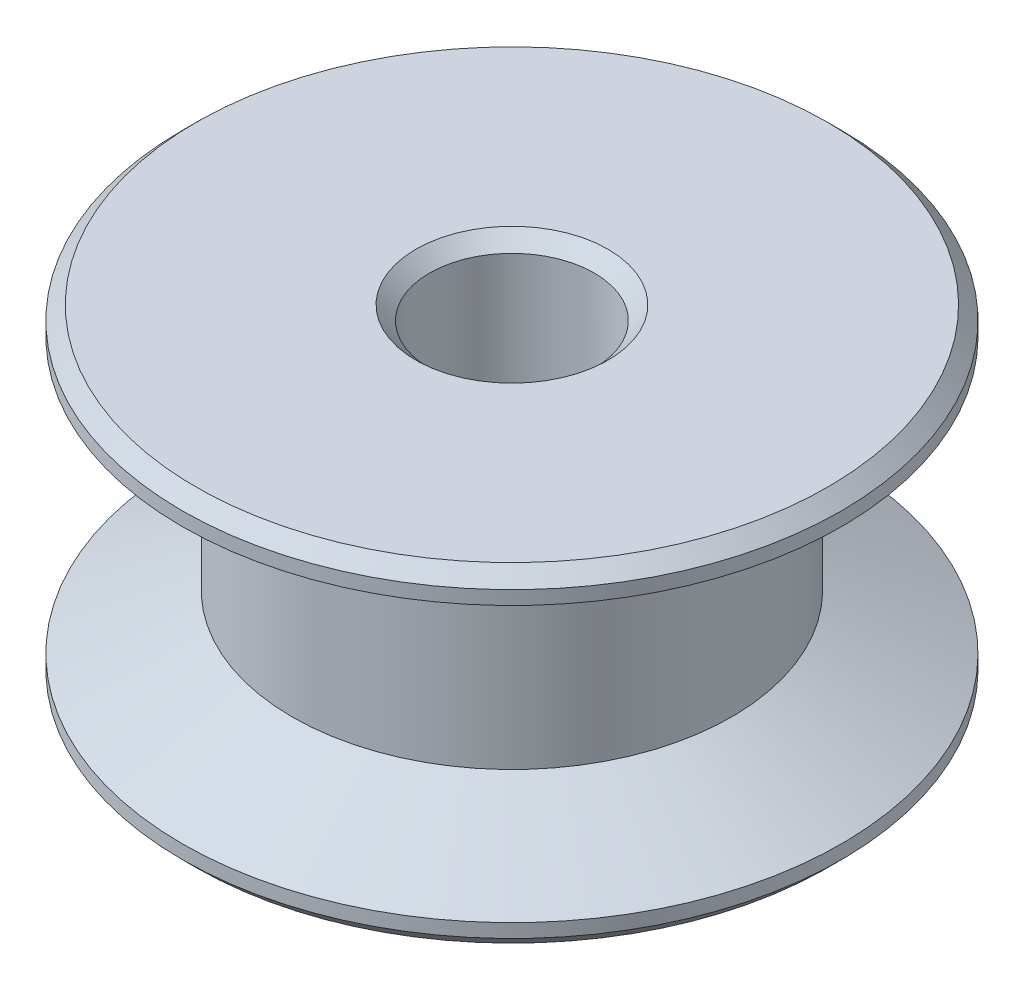
ISO-10303-21;
HEADER;
FILE_DESCRIPTION(('STEP AP214'),'2;1');
FILE_NAME('part.step','',(''),(''),'','','');
FILE_SCHEMA(('AUTOMOTIVE_DESIGN { 1 0 10303 214 1 1 1 1 }'));
ENDSEC;
DATA;
#1=APPLICATION_CONTEXT('core data for automotive mechanical design processes');
#2=APPLICATION_PROTOCOL_DEFINITION('international standard','automotive_design',2000,#1);
#3=PRODUCT_CONTEXT('',#1,'mechanical');
#4=PRODUCT('Part','Part','',(#3));
#5=PRODUCT_RELATED_PRODUCT_CATEGORY('part','',(#4));
#6=PRODUCT_DEFINITION_FORMATION('','',#4);
#7=PRODUCT_DEFINITION_CONTEXT('part definition',#1,'design');
#8=PRODUCT_DEFINITION('design','',#6,#7);
#9=PRODUCT_DEFINITION_SHAPE('','',#8);
#10=(LENGTH_UNIT() NAMED_UNIT(*) SI_UNIT(.MILLI.,.METRE.));
#11=(NAMED_UNIT(*) PLANE_ANGLE_UNIT() SI_UNIT($,.RADIAN.));
#12=(NAMED_UNIT(*) SI_UNIT($,.STERADIAN.) SOLID_ANGLE_UNIT());
#13=UNCERTAINTY_MEASURE_WITH_UNIT(LENGTH_MEASURE(1.E-05),#10,'distance_accuracy_value','');
#14=(GEOMETRIC_REPRESENTATION_CONTEXT(3) GLOBAL_UNCERTAINTY_ASSIGNED_CONTEXT((#13)) GLOBAL_UNIT_ASSIGNED_CONTEXT((#10,
#11,#12)) REPRESENTATION_CONTEXT('',''));
#15=CARTESIAN_POINT('',(0.,0.,0.));
#16=DIRECTION('',(0.,0.,1.));
#17=DIRECTION('',(1.,0.,0.));
#18=AXIS2_PLACEMENT_3D('',#15,#16,#17);
#19=CARTESIAN_POINT('',(0.,0.,0.));
#20=DIRECTION('',(0.,1.,0.));
#21=DIRECTION('',(0.,0.,1.));
#22=AXIS2_PLACEMENT_3D('',#19,#20,#21);
#23=PLANE('',#22);
#24=CARTESIAN_POINT('',(0.,0.,0.));
#25=DIRECTION('',(0.,1.,0.));
#26=DIRECTION('',(0.,0.,1.));
#27=AXIS2_PLACEMENT_3D('',#24,#25,#26);
#28=CIRCLE('',#27,9.128125);
#29=CARTESIAN_POINT('',(0.,0.,9.128125));
#30=VERTEX_POINT('',#29);
#31=EDGE_CURVE('E62',#30,#30,#28,.F.);
#32=ORIENTED_EDGE('',*,*,#31,.T.);
#33=EDGE_LOOP('',(#32));
#34=FACE_BOUND('',#33,.T.);
#35=CARTESIAN_POINT('',(0.,0.,0.));
#36=DIRECTION('',(0.,1.,0.));
#37=DIRECTION('',(0.,0.,1.));
#38=AXIS2_PLACEMENT_3D('',#35,#36,#37);
#39=CIRCLE('',#38,2.778125);
#40=CARTESIAN_POINT('',(0.,0.,2.778125));
#41=VERTEX_POINT('',#40);
#42=EDGE_CURVE('E65',#41,#41,#39,.T.);
#43=ORIENTED_EDGE('',*,*,#42,.T.);
#44=EDGE_LOOP('',(#43));
#45=FACE_BOUND('',#44,.T.);
#46=ADVANCED_FACE('F38',(#34,#45),#23,.F.);
#47=CARTESIAN_POINT('',(0.,9.525,0.));
#48=DIRECTION('',(0.,1.,0.));
#49=DIRECTION('',(0.,0.,1.));
#50=AXIS2_PLACEMENT_3D('',#47,#48,#49);
#51=CYLINDRICAL_SURFACE('',#50,9.525);
#52=CARTESIAN_POINT('',(0.,0.396875000000001,0.));
#53=DIRECTION('',(0.,1.,0.));
#54=DIRECTION('',(0.,0.,1.));
#55=AXIS2_PLACEMENT_3D('',#52,#53,#54);
#56=CIRCLE('',#55,9.525);
#57=CARTESIAN_POINT('',(0.,0.396875000000001,9.525));
#58=VERTEX_POINT('',#57);
#59=EDGE_CURVE('E68',#58,#58,#56,.T.);
#60=ORIENTED_EDGE('',*,*,#59,.T.);
#61=EDGE_LOOP('',(#60));
#62=FACE_BOUND('',#61,.T.);
#63=CARTESIAN_POINT('',(0.,0.793749999999999,0.));
#64=DIRECTION('',(0.,1.,0.));
#65=DIRECTION('',(0.,0.,1.));
#66=AXIS2_PLACEMENT_3D('',#63,#64,#65);
#67=CIRCLE('',#66,9.525);
#68=CARTESIAN_POINT('',(0.,0.793749999999999,9.525));
#69=VERTEX_POINT('',#68);
#70=EDGE_CURVE('E71',#69,#69,#67,.T.);
#71=ORIENTED_EDGE('',*,*,#70,.F.);
#72=EDGE_LOOP('',(#71));
#73=FACE_BOUND('',#72,.T.);
#74=ADVANCED_FACE('F101',(#62,#73),#51,.T.);
#75=CARTESIAN_POINT('',(0.,0.793749999999999,0.));
#76=DIRECTION('',(0.,-1.,0.));
#77=DIRECTION('',(0.,0.,-1.));
#78=AXIS2_PLACEMENT_3D('',#75,#76,#77);
#79=CONICAL_SURFACE('',#78,9.525,1.10714871779409);
#80=CARTESIAN_POINT('',(0.,2.38125,0.));
#81=DIRECTION('',(0.,1.,0.));
#82=DIRECTION('',(0.,0.,1.));
#83=AXIS2_PLACEMENT_3D('',#80,#81,#82);
#84=CIRCLE('',#83,6.35);
#85=CARTESIAN_POINT('',(0.,2.38125,6.35));
#86=VERTEX_POINT('',#85);
#87=EDGE_CURVE('E74',#86,#86,#84,.T.);
#88=ORIENTED_EDGE('',*,*,#87,.F.);
#89=EDGE_LOOP('',(#88));
#90=FACE_BOUND('',#89,.T.);
#91=ORIENTED_EDGE('',*,*,#70,.T.);
#92=EDGE_LOOP('',(#91));
#93=FACE_BOUND('',#92,.T.);
#94=ADVANCED_FACE('F95',(#90,#93),#79,.T.);
#95=CARTESIAN_POINT('',(0.,9.525,0.));
#96=DIRECTION('',(0.,1.,0.));
#97=DIRECTION('',(0.,0.,1.));
#98=AXIS2_PLACEMENT_3D('',#95,#96,#97);
#99=CYLINDRICAL_SURFACE('',#98,6.35);
#100=CARTESIAN_POINT('',(0.,7.14375,0.));
#101=DIRECTION('',(0.,1.,0.));
#102=DIRECTION('',(0.,0.,1.));
#103=AXIS2_PLACEMENT_3D('',#100,#101,#102);
#104=CIRCLE('',#103,6.35);
#105=CARTESIAN_POINT('',(0.,7.14375,6.35));
#106=VERTEX_POINT('',#105);
#107=EDGE_CURVE('E77',#106,#106,#104,.T.);
#108=ORIENTED_EDGE('',*,*,#107,.F.);
#109=EDGE_LOOP('',(#108));
#110=FACE_BOUND('',#109,.T.);
#111=ORIENTED_EDGE('',*,*,#87,.T.);
#112=EDGE_LOOP('',(#111));
#113=FACE_BOUND('',#112,.T.);
#114=ADVANCED_FACE('F89',(#110,#113),#99,.T.);
#115=CARTESIAN_POINT('',(0.,7.14375,0.));
#116=DIRECTION('',(0.,1.,0.));
#117=DIRECTION('',(0.,0.,1.));
#118=AXIS2_PLACEMENT_3D('',#115,#116,#117);
#119=CONICAL_SURFACE('',#118,6.35,1.10714871779409);
#120=CARTESIAN_POINT('',(0.,8.73125,0.));
#121=DIRECTION('',(0.,1.,0.));
#122=DIRECTION('',(0.,0.,1.));
#123=AXIS2_PLACEMENT_3D('',#120,#121,#122);
#124=CIRCLE('',#123,9.525);
#125=CARTESIAN_POINT('',(0.,8.73125,9.525));
#126=VERTEX_POINT('',#125);
#127=EDGE_CURVE('E80',#126,#126,#124,.T.);
#128=ORIENTED_EDGE('',*,*,#127,.F.);
#129=EDGE_LOOP('',(#128));
#130=FACE_BOUND('',#129,.T.);
#131=ORIENTED_EDGE('',*,*,#107,.T.);
#132=EDGE_LOOP('',(#131));
#133=FACE_BOUND('',#132,.T.);
#134=ADVANCED_FACE('F86',(#130,#133),#119,.T.);
#135=CARTESIAN_POINT('',(0.,9.525,0.));
#136=DIRECTION('',(0.,1.,0.));
#137=DIRECTION('',(0.,0.,1.));
#138=AXIS2_PLACEMENT_3D('',#135,#136,#137);
#139=CYLINDRICAL_SURFACE('',#138,9.525);
#140=CARTESIAN_POINT('',(0.,9.12812499999999,0.));
#141=DIRECTION('',(0.,-1.,0.));
#142=DIRECTION('',(0.,0.,-1.));
#143=AXIS2_PLACEMENT_3D('',#140,#141,#142);
#144=CIRCLE('',#143,9.525);
#145=CARTESIAN_POINT('',(0.,9.12812499999999,-9.525));
#146=VERTEX_POINT('',#145);
#147=EDGE_CURVE('E10',#146,#146,#144,.T.);
#148=ORIENTED_EDGE('',*,*,#147,.T.);
#149=EDGE_LOOP('',(#148));
#150=FACE_BOUND('',#149,.T.);
#151=ORIENTED_EDGE('',*,*,#127,.T.);
#152=EDGE_LOOP('',(#151));
#153=FACE_BOUND('',#152,.T.);
#154=ADVANCED_FACE('F84',(#150,#153),#139,.T.);
#155=CARTESIAN_POINT('',(9.525,9.525,0.));
#156=DIRECTION('',(0.,-1.,0.));
#157=DIRECTION('',(0.,0.,-1.));
#158=AXIS2_PLACEMENT_3D('',#155,#156,#157);
#159=PLANE('',#158);
#160=CARTESIAN_POINT('',(0.,9.525,0.));
#161=DIRECTION('',(0.,-1.,0.));
#162=DIRECTION('',(0.,0.,-1.));
#163=AXIS2_PLACEMENT_3D('',#160,#161,#162);
#164=CIRCLE('',#163,9.12812499999999);
#165=CARTESIAN_POINT('',(0.,9.525,-9.12812499999999));
#166=VERTEX_POINT('',#165);
#167=EDGE_CURVE('E46',#166,#166,#164,.F.);
#168=ORIENTED_EDGE('',*,*,#167,.T.);
#169=EDGE_LOOP('',(#168));
#170=FACE_BOUND('',#169,.T.);
#171=CARTESIAN_POINT('',(0.,9.525,0.));
#172=DIRECTION('',(0.,-1.,0.));
#173=DIRECTION('',(0.,0.,-1.));
#174=AXIS2_PLACEMENT_3D('',#171,#172,#173);
#175=CIRCLE('',#174,2.778125);
#176=CARTESIAN_POINT('',(0.,9.525,-2.778125));
#177=VERTEX_POINT('',#176);
#178=EDGE_CURVE('E50',#177,#177,#175,.T.);
#179=ORIENTED_EDGE('',*,*,#178,.T.);
#180=EDGE_LOOP('',(#179));
#181=FACE_BOUND('',#180,.T.);
#182=ADVANCED_FACE('F145',(#170,#181),#159,.F.);
#183=CARTESIAN_POINT('',(0.,0.,0.));
#184=DIRECTION('',(0.,1.,0.));
#185=DIRECTION('',(-1.,0.,0.));
#186=AXIS2_PLACEMENT_3D('',#183,#184,#185);
#187=CYLINDRICAL_SURFACE('',#186,2.38125);
#188=CARTESIAN_POINT('',(0.,0.396874999999998,0.));
#189=DIRECTION('',(0.,1.,0.));
#190=DIRECTION('',(-1.,0.,0.));
#191=AXIS2_PLACEMENT_3D('',#188,#189,#190);
#192=CIRCLE('',#191,2.38125);
#193=CARTESIAN_POINT('',(-2.38125000000001,0.396874999999999,0.));
#194=VERTEX_POINT('',#193);
#195=EDGE_CURVE('E54',#194,#194,#192,.F.);
#196=ORIENTED_EDGE('',*,*,#195,.T.);
#197=EDGE_LOOP('',(#196));
#198=FACE_BOUND('',#197,.T.);
#199=CARTESIAN_POINT('',(0.,9.128125,0.));
#200=DIRECTION('',(0.,-1.,0.));
#201=DIRECTION('',(1.,0.,0.));
#202=AXIS2_PLACEMENT_3D('',#199,#200,#201);
#203=CIRCLE('',#202,2.38125);
#204=CARTESIAN_POINT('',(2.38125,9.12812499999999,0.));
#205=VERTEX_POINT('',#204);
#206=EDGE_CURVE('E59',#205,#205,#203,.F.);
#207=ORIENTED_EDGE('',*,*,#206,.T.);
#208=EDGE_LOOP('',(#207));
#209=FACE_BOUND('',#208,.T.);
#210=ADVANCED_FACE('F122',(#198,#209),#187,.F.);
#211=CARTESIAN_POINT('',(0.,0.396875000000001,0.));
#212=DIRECTION('',(0.,1.,0.));
#213=DIRECTION('',(0.,0.,1.));
#214=AXIS2_PLACEMENT_3D('',#211,#212,#213);
#215=CONICAL_SURFACE('',#214,9.525,0.78539816339745);
#216=ORIENTED_EDGE('',*,*,#31,.F.);
#217=EDGE_LOOP('',(#216));
#218=FACE_BOUND('',#217,.T.);
#219=ORIENTED_EDGE('',*,*,#59,.F.);
#220=EDGE_LOOP('',(#219));
#221=FACE_BOUND('',#220,.T.);
#222=ADVANCED_FACE('F115',(#218,#221),#215,.T.);
#223=CARTESIAN_POINT('',(0.,0.,0.));
#224=DIRECTION('',(0.,-1.,0.));
#225=DIRECTION('',(1.,0.,0.));
#226=AXIS2_PLACEMENT_3D('',#223,#224,#225);
#227=CONICAL_SURFACE('',#226,2.77812499999999,0.785398163397444);
#228=ORIENTED_EDGE('',*,*,#195,.F.);
#229=EDGE_LOOP('',(#228));
#230=FACE_BOUND('',#229,.T.);
#231=ORIENTED_EDGE('',*,*,#42,.F.);
#232=EDGE_LOOP('',(#231));
#233=FACE_BOUND('',#232,.T.);
#234=ADVANCED_FACE('F121',(#230,#233),#227,.F.);
#235=CARTESIAN_POINT('',(0.,9.525,0.));
#236=DIRECTION('',(0.,-1.,0.));
#237=DIRECTION('',(0.,0.,-1.));
#238=AXIS2_PLACEMENT_3D('',#235,#236,#237);
#239=CONICAL_SURFACE('',#238,9.12812499999999,0.78539816339745);
#240=ORIENTED_EDGE('',*,*,#147,.F.);
#241=EDGE_LOOP('',(#240));
#242=FACE_BOUND('',#241,.T.);
#243=ORIENTED_EDGE('',*,*,#167,.F.);
#244=EDGE_LOOP('',(#243));
#245=FACE_BOUND('',#244,.T.);
#246=ADVANCED_FACE('F128',(#242,#245),#239,.T.);
#247=CARTESIAN_POINT('',(0.,9.525,0.));
#248=DIRECTION('',(0.,1.,0.));
#249=DIRECTION('',(-1.,0.,0.));
#250=AXIS2_PLACEMENT_3D('',#247,#248,#249);
#251=CONICAL_SURFACE('',#250,2.778125,0.785398163397443);
#252=ORIENTED_EDGE('',*,*,#206,.F.);
#253=EDGE_LOOP('',(#252));
#254=FACE_BOUND('',#253,.T.);
#255=ORIENTED_EDGE('',*,*,#178,.F.);
#256=EDGE_LOOP('',(#255));
#257=FACE_BOUND('',#256,.T.);
#258=ADVANCED_FACE('F41',(#254,#257),#251,.F.);
#259=CLOSED_SHELL('',(#46,#74,#94,#114,#134,#154,#182,#210,#222,#234,#246,#258));
#260=MANIFOLD_SOLID_BREP('B2',#259);
#261=ADVANCED_BREP_SHAPE_REPRESENTATION('',(#18,#260),#14);
#262=SHAPE_DEFINITION_REPRESENTATION(#9,#261);
ENDSEC;
END-ISO-10303-21;
